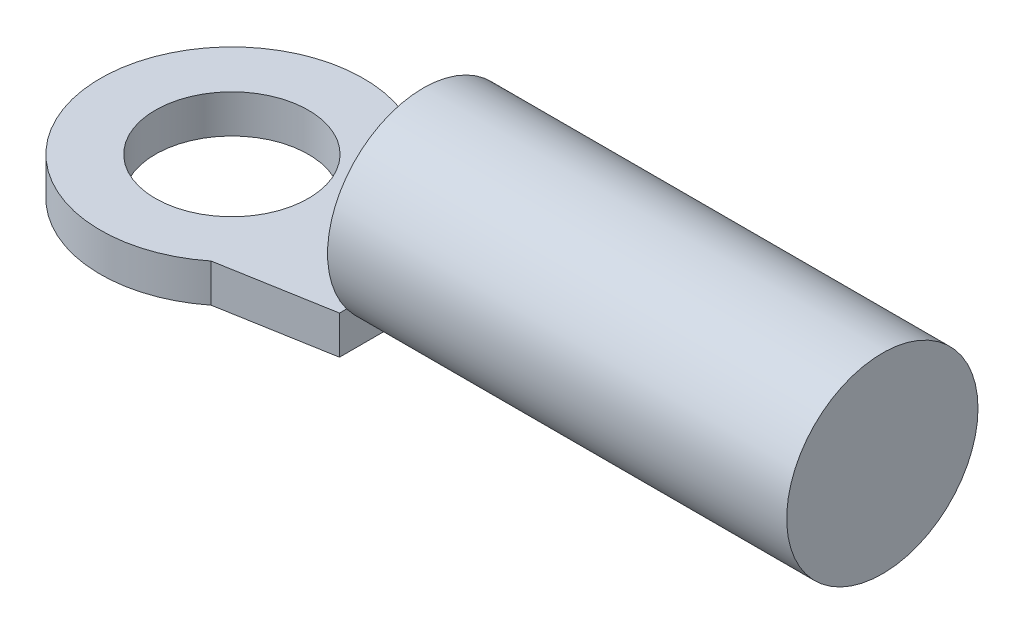
ISO-10303-21;
HEADER;
FILE_DESCRIPTION(('STEP AP214'),'2;1');
FILE_NAME('part.step','',(''),(''),'','','');
FILE_SCHEMA(('AUTOMOTIVE_DESIGN { 1 0 10303 214 1 1 1 1 }'));
ENDSEC;
DATA;
#1=APPLICATION_CONTEXT('core data for automotive mechanical design processes');
#2=APPLICATION_PROTOCOL_DEFINITION('international standard','automotive_design',2000,#1);
#3=PRODUCT_CONTEXT('',#1,'mechanical');
#4=PRODUCT('Part','Part','',(#3));
#5=PRODUCT_RELATED_PRODUCT_CATEGORY('part','',(#4));
#6=PRODUCT_DEFINITION_FORMATION('','',#4);
#7=PRODUCT_DEFINITION_CONTEXT('part definition',#1,'design');
#8=PRODUCT_DEFINITION('design','',#6,#7);
#9=PRODUCT_DEFINITION_SHAPE('','',#8);
#10=(LENGTH_UNIT() NAMED_UNIT(*) SI_UNIT(.MILLI.,.METRE.));
#11=(NAMED_UNIT(*) PLANE_ANGLE_UNIT() SI_UNIT($,.RADIAN.));
#12=(NAMED_UNIT(*) SI_UNIT($,.STERADIAN.) SOLID_ANGLE_UNIT());
#13=UNCERTAINTY_MEASURE_WITH_UNIT(LENGTH_MEASURE(1.E-05),#10,'distance_accuracy_value','');
#14=(GEOMETRIC_REPRESENTATION_CONTEXT(3) GLOBAL_UNCERTAINTY_ASSIGNED_CONTEXT((#13)) GLOBAL_UNIT_ASSIGNED_CONTEXT((#10,
#11,#12)) REPRESENTATION_CONTEXT('',''));
#15=CARTESIAN_POINT('',(0.,0.,0.));
#16=DIRECTION('',(0.,0.,1.));
#17=DIRECTION('',(1.,0.,0.));
#18=AXIS2_PLACEMENT_3D('',#15,#16,#17);
#19=CARTESIAN_POINT('',(4.,0.8,0.));
#20=DIRECTION('',(1.,0.,0.));
#21=DIRECTION('',(0.,0.,-1.));
#22=AXIS2_PLACEMENT_3D('',#19,#20,#21);
#23=PLANE('',#22);
#24=CARTESIAN_POINT('',(4.,2.,0.));
#25=DIRECTION('',(1.,0.,0.));
#26=DIRECTION('',(0.,0.,-1.));
#27=AXIS2_PLACEMENT_3D('',#24,#25,#26);
#28=CIRCLE('',#27,2.);
#29=CARTESIAN_POINT('',(4.,0.8,1.6));
#30=VERTEX_POINT('',#29);
#31=CARTESIAN_POINT('',(4.,0.,0.));
#32=VERTEX_POINT('',#31);
#33=EDGE_CURVE('E46',#30,#32,#28,.T.);
#34=ORIENTED_EDGE('',*,*,#33,.F.);
#35=DIRECTION('',(0.,0.,1.));
#36=VECTOR('',#35,1.);
#37=CARTESIAN_POINT('',(4.,0.8,0.));
#38=LINE('',#37,#36);
#39=CARTESIAN_POINT('',(4.,0.8,1.75));
#40=VERTEX_POINT('',#39);
#41=EDGE_CURVE('E92',#30,#40,#38,.T.);
#42=ORIENTED_EDGE('',*,*,#41,.T.);
#43=DIRECTION('',(0.,-1.,0.));
#44=VECTOR('',#43,1.);
#45=CARTESIAN_POINT('',(4.,0.8,1.75));
#46=LINE('',#45,#44);
#47=CARTESIAN_POINT('',(4.,0.,1.75));
#48=VERTEX_POINT('',#47);
#49=EDGE_CURVE('E117',#40,#48,#46,.T.);
#50=ORIENTED_EDGE('',*,*,#49,.T.);
#51=DIRECTION('',(0.,0.,1.));
#52=VECTOR('',#51,1.);
#53=CARTESIAN_POINT('',(4.,0.,0.));
#54=LINE('',#53,#52);
#55=EDGE_CURVE('E105',#32,#48,#54,.T.);
#56=ORIENTED_EDGE('',*,*,#55,.F.);
#57=EDGE_LOOP('',(#34,#42,#50,#56));
#58=FACE_BOUND('',#57,.T.);
#59=ADVANCED_FACE('F36',(#58),#23,.T.);
#60=CARTESIAN_POINT('',(4.,0.8,-1.6));
#61=VERTEX_POINT('',#60);
#62=EDGE_CURVE('E11',#32,#61,#28,.T.);
#63=ORIENTED_EDGE('',*,*,#62,.F.);
#64=CARTESIAN_POINT('',(4.,0.,-1.75));
#65=VERTEX_POINT('',#64);
#66=EDGE_CURVE('E118',#65,#32,#54,.T.);
#67=ORIENTED_EDGE('',*,*,#66,.F.);
#68=DIRECTION('',(0.,-1.,0.));
#69=VECTOR('',#68,1.);
#70=CARTESIAN_POINT('',(4.,0.8,-1.75));
#71=LINE('',#70,#69);
#72=CARTESIAN_POINT('',(4.,0.8,-1.75));
#73=VERTEX_POINT('',#72);
#74=EDGE_CURVE('E40',#73,#65,#71,.T.);
#75=ORIENTED_EDGE('',*,*,#74,.F.);
#76=EDGE_CURVE('E85',#73,#61,#38,.T.);
#77=ORIENTED_EDGE('',*,*,#76,.T.);
#78=EDGE_LOOP('',(#63,#67,#75,#77));
#79=FACE_BOUND('',#78,.T.);
#80=ADVANCED_FACE('F38',(#79),#23,.T.);
#81=CARTESIAN_POINT('',(0.416089419203324,0.8,-2.37728235429973));
#82=DIRECTION('',(-0.17240646700263,0.,0.985025893129552));
#83=DIRECTION('',(0.985025893129552,0.,0.17240646700263));
#84=AXIS2_PLACEMENT_3D('',#81,#82,#83);
#85=PLANE('',#84);
#86=DIRECTION('',(-0.985025893129552,0.,-0.17240646700263));
#87=VECTOR('',#86,1.);
#88=CARTESIAN_POINT('',(0.416089419203324,0.,-2.37728235429973));
#89=LINE('',#88,#87);
#90=CARTESIAN_POINT('',(1.71464281994822,0.,-2.15));
#91=VERTEX_POINT('',#90);
#92=EDGE_CURVE('E121',#65,#91,#89,.T.);
#93=ORIENTED_EDGE('',*,*,#92,.T.);
#94=DIRECTION('',(0.,-1.,0.));
#95=VECTOR('',#94,1.);
#96=CARTESIAN_POINT('',(1.71464281994822,0.8,-2.15));
#97=LINE('',#96,#95);
#98=CARTESIAN_POINT('',(1.71464281994822,0.8,-2.15));
#99=VERTEX_POINT('',#98);
#100=EDGE_CURVE('E135',#99,#91,#97,.T.);
#101=ORIENTED_EDGE('',*,*,#100,.F.);
#102=DIRECTION('',(-0.985025893129552,0.,-0.17240646700263));
#103=VECTOR('',#102,1.);
#104=CARTESIAN_POINT('',(0.416089419203324,0.8,-2.37728235429973));
#105=LINE('',#104,#103);
#106=EDGE_CURVE('E89',#73,#99,#105,.T.);
#107=ORIENTED_EDGE('',*,*,#106,.F.);
#108=ORIENTED_EDGE('',*,*,#74,.T.);
#109=EDGE_LOOP('',(#93,#101,#107,#108));
#110=FACE_BOUND('',#109,.T.);
#111=ADVANCED_FACE('F143',(#110),#85,.F.);
#112=CARTESIAN_POINT('',(0.,0.8,0.));
#113=DIRECTION('',(0.,-1.,0.));
#114=DIRECTION('',(0.,0.,-1.));
#115=AXIS2_PLACEMENT_3D('',#112,#113,#114);
#116=CYLINDRICAL_SURFACE('',#115,2.75);
#117=CARTESIAN_POINT('',(0.,0.,0.));
#118=DIRECTION('',(0.,1.,0.));
#119=DIRECTION('',(0.,0.,1.));
#120=AXIS2_PLACEMENT_3D('',#117,#118,#119);
#121=CIRCLE('',#120,2.75);
#122=CARTESIAN_POINT('',(1.71464281994822,0.,2.15));
#123=VERTEX_POINT('',#122);
#124=EDGE_CURVE('E123',#91,#123,#121,.T.);
#125=ORIENTED_EDGE('',*,*,#124,.T.);
#126=DIRECTION('',(0.,-1.,0.));
#127=VECTOR('',#126,1.);
#128=CARTESIAN_POINT('',(1.71464281994822,0.8,2.15));
#129=LINE('',#128,#127);
#130=CARTESIAN_POINT('',(1.71464281994822,0.8,2.15));
#131=VERTEX_POINT('',#130);
#132=EDGE_CURVE('E134',#131,#123,#129,.T.);
#133=ORIENTED_EDGE('',*,*,#132,.F.);
#134=CARTESIAN_POINT('',(0.,0.8,0.));
#135=DIRECTION('',(0.,1.,0.));
#136=DIRECTION('',(0.,0.,1.));
#137=AXIS2_PLACEMENT_3D('',#134,#135,#136);
#138=CIRCLE('',#137,2.75);
#139=EDGE_CURVE('E109',#99,#131,#138,.T.);
#140=ORIENTED_EDGE('',*,*,#139,.F.);
#141=ORIENTED_EDGE('',*,*,#100,.T.);
#142=EDGE_LOOP('',(#125,#133,#140,#141));
#143=FACE_BOUND('',#142,.T.);
#144=ADVANCED_FACE('F149',(#143),#116,.T.);
#145=CARTESIAN_POINT('',(0.416089419203326,0.8,2.37728235429973));
#146=DIRECTION('',(0.172406467002631,0.,0.985025893129552));
#147=DIRECTION('',(0.985025893129552,0.,-0.172406467002631));
#148=AXIS2_PLACEMENT_3D('',#145,#146,#147);
#149=PLANE('',#148);
#150=DIRECTION('',(-0.985025893129552,0.,0.172406467002631));
#151=VECTOR('',#150,1.);
#152=CARTESIAN_POINT('',(0.416089419203326,0.,2.37728235429973));
#153=LINE('',#152,#151);
#154=EDGE_CURVE('E126',#48,#123,#153,.T.);
#155=ORIENTED_EDGE('',*,*,#154,.F.);
#156=ORIENTED_EDGE('',*,*,#49,.F.);
#157=DIRECTION('',(-0.985025893129552,0.,0.172406467002631));
#158=VECTOR('',#157,1.);
#159=CARTESIAN_POINT('',(0.416089419203326,0.8,2.37728235429973));
#160=LINE('',#159,#158);
#161=EDGE_CURVE('E111',#40,#131,#160,.T.);
#162=ORIENTED_EDGE('',*,*,#161,.T.);
#163=ORIENTED_EDGE('',*,*,#132,.T.);
#164=EDGE_LOOP('',(#155,#156,#162,#163));
#165=FACE_BOUND('',#164,.T.);
#166=ADVANCED_FACE('F152',(#165),#149,.T.);
#167=CARTESIAN_POINT('',(0.,0.8,0.));
#168=DIRECTION('',(0.,-1.,0.));
#169=DIRECTION('',(0.,0.,-1.));
#170=AXIS2_PLACEMENT_3D('',#167,#168,#169);
#171=CYLINDRICAL_SURFACE('',#170,1.6);
#172=CARTESIAN_POINT('',(0.,0.8,0.));
#173=DIRECTION('',(0.,1.,0.));
#174=DIRECTION('',(0.,0.,1.));
#175=AXIS2_PLACEMENT_3D('',#172,#173,#174);
#176=CIRCLE('',#175,1.6);
#177=CARTESIAN_POINT('',(0.,0.8,1.6));
#178=VERTEX_POINT('',#177);
#179=EDGE_CURVE('E114',#178,#178,#176,.T.);
#180=ORIENTED_EDGE('',*,*,#179,.T.);
#181=EDGE_LOOP('',(#180));
#182=FACE_BOUND('',#181,.T.);
#183=CARTESIAN_POINT('',(0.,0.,0.));
#184=DIRECTION('',(0.,1.,0.));
#185=DIRECTION('',(0.,0.,1.));
#186=AXIS2_PLACEMENT_3D('',#183,#184,#185);
#187=CIRCLE('',#186,1.6);
#188=CARTESIAN_POINT('',(0.,0.,1.6));
#189=VERTEX_POINT('',#188);
#190=EDGE_CURVE('E129',#189,#189,#187,.T.);
#191=ORIENTED_EDGE('',*,*,#190,.F.);
#192=EDGE_LOOP('',(#191));
#193=FACE_BOUND('',#192,.T.);
#194=ADVANCED_FACE('F167',(#182,#193),#171,.F.);
#195=CARTESIAN_POINT('',(0.,0.8,0.));
#196=DIRECTION('',(0.,1.,0.));
#197=DIRECTION('',(0.,0.,1.));
#198=AXIS2_PLACEMENT_3D('',#195,#196,#197);
#199=PLANE('',#198);
#200=ORIENTED_EDGE('',*,*,#76,.F.);
#201=ORIENTED_EDGE('',*,*,#106,.T.);
#202=ORIENTED_EDGE('',*,*,#139,.T.);
#203=ORIENTED_EDGE('',*,*,#161,.F.);
#204=ORIENTED_EDGE('',*,*,#41,.F.);
#205=EDGE_CURVE('E90',#61,#30,#38,.T.);
#206=ORIENTED_EDGE('',*,*,#205,.F.);
#207=EDGE_LOOP('',(#200,#201,#202,#203,#204,#206));
#208=FACE_BOUND('',#207,.T.);
#209=ORIENTED_EDGE('',*,*,#179,.F.);
#210=EDGE_LOOP('',(#209));
#211=FACE_BOUND('',#210,.T.);
#212=ADVANCED_FACE('F95',(#208,#211),#199,.T.);
#213=CARTESIAN_POINT('',(0.,0.,0.));
#214=DIRECTION('',(0.,1.,0.));
#215=DIRECTION('',(0.,0.,1.));
#216=AXIS2_PLACEMENT_3D('',#213,#214,#215);
#217=PLANE('',#216);
#218=ORIENTED_EDGE('',*,*,#66,.T.);
#219=ORIENTED_EDGE('',*,*,#55,.T.);
#220=ORIENTED_EDGE('',*,*,#154,.T.);
#221=ORIENTED_EDGE('',*,*,#124,.F.);
#222=ORIENTED_EDGE('',*,*,#92,.F.);
#223=EDGE_LOOP('',(#218,#219,#220,#221,#222));
#224=FACE_BOUND('',#223,.T.);
#225=ORIENTED_EDGE('',*,*,#190,.T.);
#226=EDGE_LOOP('',(#225));
#227=FACE_BOUND('',#226,.T.);
#228=ADVANCED_FACE('F145',(#224,#227),#217,.F.);
#229=CARTESIAN_POINT('',(4.,2.,0.));
#230=DIRECTION('',(1.,0.,0.));
#231=DIRECTION('',(0.,0.,-1.));
#232=AXIS2_PLACEMENT_3D('',#229,#230,#231);
#233=PLANE('',#232);
#234=EDGE_CURVE('E47',#61,#30,#28,.T.);
#235=ORIENTED_EDGE('',*,*,#234,.F.);
#236=ORIENTED_EDGE('',*,*,#205,.T.);
#237=EDGE_LOOP('',(#235,#236));
#238=FACE_BOUND('',#237,.T.);
#239=ADVANCED_FACE('F100',(#238),#233,.F.);
#240=CARTESIAN_POINT('',(13.6,2.,0.));
#241=DIRECTION('',(-1.,0.,0.));
#242=DIRECTION('',(0.,0.,1.));
#243=AXIS2_PLACEMENT_3D('',#240,#241,#242);
#244=CYLINDRICAL_SURFACE('',#243,2.);
#245=CARTESIAN_POINT('',(13.6,2.,0.));
#246=DIRECTION('',(1.,0.,0.));
#247=DIRECTION('',(0.,0.,-1.));
#248=AXIS2_PLACEMENT_3D('',#245,#246,#247);
#249=CIRCLE('',#248,2.);
#250=CARTESIAN_POINT('',(13.6,2.,-2.));
#251=VERTEX_POINT('',#250);
#252=EDGE_CURVE('E103',#251,#251,#249,.T.);
#253=ORIENTED_EDGE('',*,*,#252,.F.);
#254=EDGE_LOOP('',(#253));
#255=FACE_BOUND('',#254,.T.);
#256=ORIENTED_EDGE('',*,*,#33,.T.);
#257=ORIENTED_EDGE('',*,*,#62,.T.);
#258=ORIENTED_EDGE('',*,*,#234,.T.);
#259=EDGE_LOOP('',(#256,#257,#258));
#260=FACE_BOUND('',#259,.T.);
#261=ADVANCED_FACE('F102',(#255,#260),#244,.T.);
#262=CARTESIAN_POINT('',(13.6,2.,0.));
#263=DIRECTION('',(1.,0.,0.));
#264=DIRECTION('',(0.,0.,-1.));
#265=AXIS2_PLACEMENT_3D('',#262,#263,#264);
#266=PLANE('',#265);
#267=ORIENTED_EDGE('',*,*,#252,.T.);
#268=EDGE_LOOP('',(#267));
#269=FACE_BOUND('',#268,.T.);
#270=ADVANCED_FACE('F177',(#269),#266,.T.);
#271=CLOSED_SHELL('',(#59,#80,#111,#144,#166,#194,#212,#228,#239,#261,#270));
#272=MANIFOLD_SOLID_BREP('B2',#271);
#273=ADVANCED_BREP_SHAPE_REPRESENTATION('',(#18,#272),#14);
#274=SHAPE_DEFINITION_REPRESENTATION(#9,#273);
ENDSEC;
END-ISO-10303-21;
